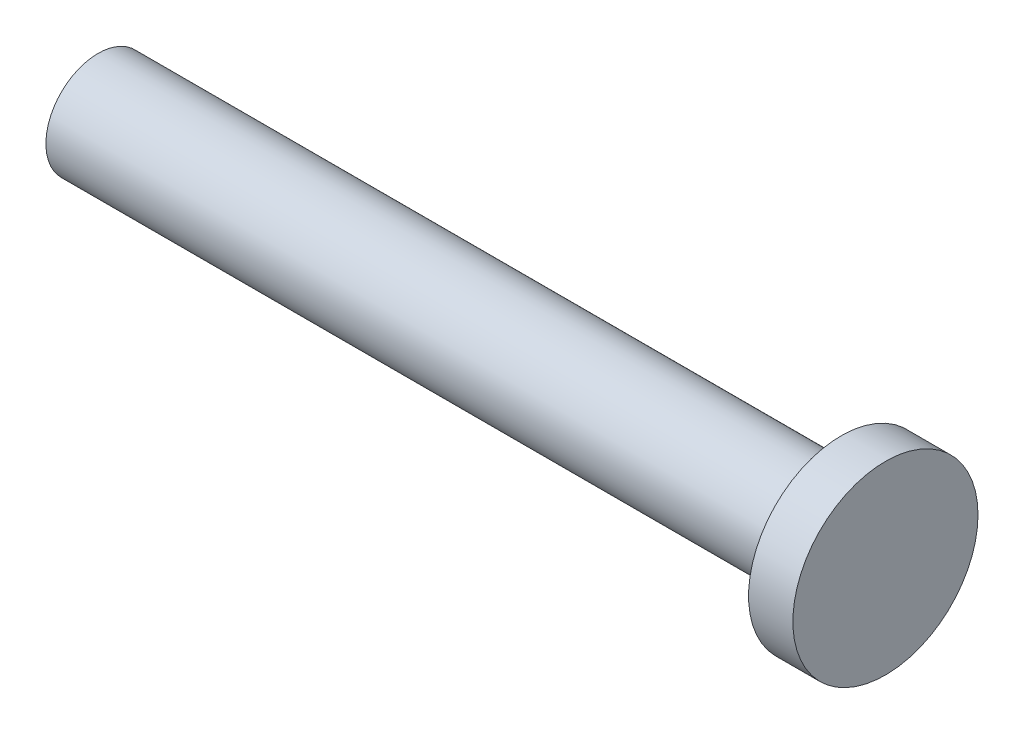
ISO-10303-21;
HEADER;
FILE_DESCRIPTION(('STEP AP214'),'2;1');
FILE_NAME('part.step','',(''),(''),'','','');
FILE_SCHEMA(('AUTOMOTIVE_DESIGN { 1 0 10303 214 1 1 1 1 }'));
ENDSEC;
DATA;
#1=APPLICATION_CONTEXT('core data for automotive mechanical design processes');
#2=APPLICATION_PROTOCOL_DEFINITION('international standard','automotive_design',2000,#1);
#3=PRODUCT_CONTEXT('',#1,'mechanical');
#4=PRODUCT('Part','Part','',(#3));
#5=PRODUCT_RELATED_PRODUCT_CATEGORY('part','',(#4));
#6=PRODUCT_DEFINITION_FORMATION('','',#4);
#7=PRODUCT_DEFINITION_CONTEXT('part definition',#1,'design');
#8=PRODUCT_DEFINITION('design','',#6,#7);
#9=PRODUCT_DEFINITION_SHAPE('','',#8);
#10=(LENGTH_UNIT() NAMED_UNIT(*) SI_UNIT(.MILLI.,.METRE.));
#11=(NAMED_UNIT(*) PLANE_ANGLE_UNIT() SI_UNIT($,.RADIAN.));
#12=(NAMED_UNIT(*) SI_UNIT($,.STERADIAN.) SOLID_ANGLE_UNIT());
#13=UNCERTAINTY_MEASURE_WITH_UNIT(LENGTH_MEASURE(1.E-05),#10,'distance_accuracy_value','');
#14=(GEOMETRIC_REPRESENTATION_CONTEXT(3) GLOBAL_UNCERTAINTY_ASSIGNED_CONTEXT((#13)) GLOBAL_UNIT_ASSIGNED_CONTEXT((#10,
#11,#12)) REPRESENTATION_CONTEXT('',''));
#15=CARTESIAN_POINT('',(0.,0.,0.));
#16=DIRECTION('',(0.,0.,1.));
#17=DIRECTION('',(1.,0.,0.));
#18=AXIS2_PLACEMENT_3D('',#15,#16,#17);
#19=CARTESIAN_POINT('',(142.5,0.,0.));
#20=DIRECTION('',(-1.,0.,0.));
#21=DIRECTION('',(0.,0.,1.));
#22=AXIS2_PLACEMENT_3D('',#19,#20,#21);
#23=CYLINDRICAL_SURFACE('',#22,9.99999999999999);
#24=CARTESIAN_POINT('',(142.5,0.,0.));
#25=DIRECTION('',(1.,0.,0.));
#26=DIRECTION('',(0.,0.,-1.));
#27=AXIS2_PLACEMENT_3D('',#24,#25,#26);
#28=CIRCLE('',#27,9.99999999999999);
#29=CARTESIAN_POINT('',(142.5,0.,-9.99999999999999));
#30=VERTEX_POINT('',#29);
#31=EDGE_CURVE('E10',#30,#30,#28,.T.);
#32=ORIENTED_EDGE('',*,*,#31,.F.);
#33=EDGE_LOOP('',(#32));
#34=FACE_BOUND('',#33,.T.);
#35=CARTESIAN_POINT('',(0.,0.,0.));
#36=DIRECTION('',(1.,0.,0.));
#37=DIRECTION('',(0.,0.,-1.));
#38=AXIS2_PLACEMENT_3D('',#35,#36,#37);
#39=CIRCLE('',#38,9.99999999999999);
#40=CARTESIAN_POINT('',(0.,0.,-9.99999999999999));
#41=VERTEX_POINT('',#40);
#42=EDGE_CURVE('E40',#41,#41,#39,.T.);
#43=ORIENTED_EDGE('',*,*,#42,.T.);
#44=EDGE_LOOP('',(#43));
#45=FACE_BOUND('',#44,.T.);
#46=ADVANCED_FACE('F37',(#34,#45),#23,.T.);
#47=CARTESIAN_POINT('',(0.,0.,0.));
#48=DIRECTION('',(1.,0.,0.));
#49=DIRECTION('',(0.,0.,-1.));
#50=AXIS2_PLACEMENT_3D('',#47,#48,#49);
#51=PLANE('',#50);
#52=ORIENTED_EDGE('',*,*,#42,.F.);
#53=EDGE_LOOP('',(#52));
#54=FACE_BOUND('',#53,.T.);
#55=ADVANCED_FACE('F64',(#54),#51,.F.);
#56=CARTESIAN_POINT('',(151.,0.,0.));
#57=DIRECTION('',(-1.,0.,0.));
#58=DIRECTION('',(0.,0.,1.));
#59=AXIS2_PLACEMENT_3D('',#56,#57,#58);
#60=CYLINDRICAL_SURFACE('',#59,17.75);
#61=CARTESIAN_POINT('',(151.,0.,0.));
#62=DIRECTION('',(1.,0.,0.));
#63=DIRECTION('',(0.,0.,-1.));
#64=AXIS2_PLACEMENT_3D('',#61,#62,#63);
#65=CIRCLE('',#64,17.75);
#66=CARTESIAN_POINT('',(151.,0.,-17.75));
#67=VERTEX_POINT('',#66);
#68=EDGE_CURVE('E49',#67,#67,#65,.T.);
#69=ORIENTED_EDGE('',*,*,#68,.F.);
#70=EDGE_LOOP('',(#69));
#71=FACE_BOUND('',#70,.T.);
#72=CARTESIAN_POINT('',(142.5,0.,0.));
#73=DIRECTION('',(1.,0.,0.));
#74=DIRECTION('',(0.,0.,-1.));
#75=AXIS2_PLACEMENT_3D('',#72,#73,#74);
#76=CIRCLE('',#75,17.75);
#77=CARTESIAN_POINT('',(142.5,0.,-17.75));
#78=VERTEX_POINT('',#77);
#79=EDGE_CURVE('E51',#78,#78,#76,.T.);
#80=ORIENTED_EDGE('',*,*,#79,.T.);
#81=EDGE_LOOP('',(#80));
#82=FACE_BOUND('',#81,.T.);
#83=ADVANCED_FACE('F61',(#71,#82),#60,.T.);
#84=CARTESIAN_POINT('',(151.,0.,0.));
#85=DIRECTION('',(1.,0.,0.));
#86=DIRECTION('',(0.,0.,-1.));
#87=AXIS2_PLACEMENT_3D('',#84,#85,#86);
#88=PLANE('',#87);
#89=ORIENTED_EDGE('',*,*,#68,.T.);
#90=EDGE_LOOP('',(#89));
#91=FACE_BOUND('',#90,.T.);
#92=ADVANCED_FACE('F59',(#91),#88,.T.);
#93=CARTESIAN_POINT('',(142.5,0.,0.));
#94=DIRECTION('',(1.,0.,0.));
#95=DIRECTION('',(0.,0.,-1.));
#96=AXIS2_PLACEMENT_3D('',#93,#94,#95);
#97=PLANE('',#96);
#98=ORIENTED_EDGE('',*,*,#31,.T.);
#99=EDGE_LOOP('',(#98));
#100=FACE_BOUND('',#99,.T.);
#101=ORIENTED_EDGE('',*,*,#79,.F.);
#102=EDGE_LOOP('',(#101));
#103=FACE_BOUND('',#102,.T.);
#104=ADVANCED_FACE('F68',(#100,#103),#97,.F.);
#105=CLOSED_SHELL('',(#46,#55,#83,#92,#104));
#106=MANIFOLD_SOLID_BREP('B2',#105);
#107=ADVANCED_BREP_SHAPE_REPRESENTATION('',(#18,#106),#14);
#108=SHAPE_DEFINITION_REPRESENTATION(#9,#107);
ENDSEC;
END-ISO-10303-21;
